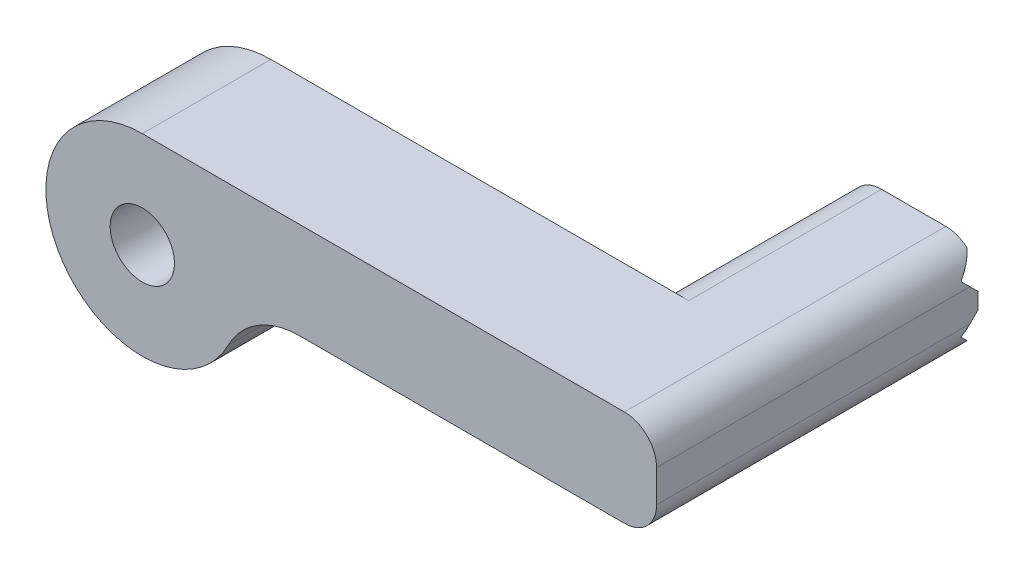
ISO-10303-21;
HEADER;
FILE_DESCRIPTION(('STEP AP214'),'2;1');
FILE_NAME('part.step','',(''),(''),'','','');
FILE_SCHEMA(('AUTOMOTIVE_DESIGN { 1 0 10303 214 1 1 1 1 }'));
ENDSEC;
DATA;
#1=APPLICATION_CONTEXT('core data for automotive mechanical design processes');
#2=APPLICATION_PROTOCOL_DEFINITION('international standard','automotive_design',2000,#1);
#3=PRODUCT_CONTEXT('',#1,'mechanical');
#4=PRODUCT('Part','Part','',(#3));
#5=PRODUCT_RELATED_PRODUCT_CATEGORY('part','',(#4));
#6=PRODUCT_DEFINITION_FORMATION('','',#4);
#7=PRODUCT_DEFINITION_CONTEXT('part definition',#1,'design');
#8=PRODUCT_DEFINITION('design','',#6,#7);
#9=PRODUCT_DEFINITION_SHAPE('','',#8);
#10=(LENGTH_UNIT() NAMED_UNIT(*) SI_UNIT(.MILLI.,.METRE.));
#11=(NAMED_UNIT(*) PLANE_ANGLE_UNIT() SI_UNIT($,.RADIAN.));
#12=(NAMED_UNIT(*) SI_UNIT($,.STERADIAN.) SOLID_ANGLE_UNIT());
#13=UNCERTAINTY_MEASURE_WITH_UNIT(LENGTH_MEASURE(1.E-05),#10,'distance_accuracy_value','');
#14=(GEOMETRIC_REPRESENTATION_CONTEXT(3) GLOBAL_UNCERTAINTY_ASSIGNED_CONTEXT((#13)) GLOBAL_UNIT_ASSIGNED_CONTEXT((#10,
#11,#12)) REPRESENTATION_CONTEXT('',''));
#15=CARTESIAN_POINT('',(0.,0.,0.));
#16=DIRECTION('',(0.,0.,1.));
#17=DIRECTION('',(1.,0.,0.));
#18=AXIS2_PLACEMENT_3D('',#15,#16,#17);
#19=CARTESIAN_POINT('',(0.,0.,-12.));
#20=DIRECTION('',(0.,0.,1.));
#21=DIRECTION('',(1.,0.,0.));
#22=AXIS2_PLACEMENT_3D('',#19,#20,#21);
#23=PLANE('',#22);
#24=CARTESIAN_POINT('',(-25.3162358800759,68.971177362986,-12.));
#25=DIRECTION('',(0.,0.,1.));
#26=DIRECTION('',(1.,0.,0.));
#27=AXIS2_PLACEMENT_3D('',#24,#25,#26);
#28=CIRCLE('',#27,2.);
#29=CARTESIAN_POINT('',(-25.3162358800759,70.971177362986,-12.));
#30=VERTEX_POINT('',#29);
#31=CARTESIAN_POINT('',(-23.9933602245436,70.4711773629859,-12.));
#32=VERTEX_POINT('',#31);
#33=EDGE_CURVE('E206',#30,#32,#28,.F.);
#34=ORIENTED_EDGE('',*,*,#33,.T.);
#35=DIRECTION('',(-1.,0.,0.));
#36=VECTOR('',#35,1.);
#37=CARTESIAN_POINT('',(-23.3162358800759,70.4711773629859,-12.));
#38=LINE('',#37,#36);
#39=CARTESIAN_POINT('',(-30.6391115356081,70.471177362986,-12.));
#40=VERTEX_POINT('',#39);
#41=EDGE_CURVE('E331',#32,#40,#38,.T.);
#42=ORIENTED_EDGE('',*,*,#41,.T.);
#43=CARTESIAN_POINT('',(-29.3162358800759,68.971177362986,-12.));
#44=DIRECTION('',(0.,0.,1.));
#45=DIRECTION('',(1.,0.,0.));
#46=AXIS2_PLACEMENT_3D('',#43,#44,#45);
#47=CIRCLE('',#46,2.);
#48=CARTESIAN_POINT('',(-29.3162358800759,70.971177362986,-12.));
#49=VERTEX_POINT('',#48);
#50=EDGE_CURVE('E214',#40,#49,#47,.F.);
#51=ORIENTED_EDGE('',*,*,#50,.T.);
#52=DIRECTION('',(-1.,0.,0.));
#53=VECTOR('',#52,1.);
#54=CARTESIAN_POINT('',(-23.3162358800759,70.971177362986,-12.));
#55=LINE('',#54,#53);
#56=EDGE_CURVE('E178',#30,#49,#55,.T.);
#57=ORIENTED_EDGE('',*,*,#56,.F.);
#58=EDGE_LOOP('',(#34,#42,#51,#57));
#59=FACE_BOUND('',#58,.T.);
#60=ADVANCED_FACE('F34',(#59),#23,.F.);
#61=DIRECTION('',(0.,-1.,0.));
#62=VECTOR('',#61,1.);
#63=CARTESIAN_POINT('',(-31.3162358800759,67.971177362986,-12.));
#64=LINE('',#63,#62);
#65=CARTESIAN_POINT('',(-31.3162358800759,68.471177362986,-12.));
#66=VERTEX_POINT('',#65);
#67=CARTESIAN_POINT('',(-31.3162358800759,67.471177362986,-12.));
#68=VERTEX_POINT('',#67);
#69=EDGE_CURVE('E185',#66,#68,#64,.T.);
#70=ORIENTED_EDGE('',*,*,#69,.F.);
#71=DIRECTION('',(-1.,0.,0.));
#72=VECTOR('',#71,1.);
#73=CARTESIAN_POINT('',(-23.3162358800759,68.471177362986,-12.));
#74=LINE('',#73,#72);
#75=CARTESIAN_POINT('',(-23.3162358800759,68.471177362986,-12.));
#76=VERTEX_POINT('',#75);
#77=EDGE_CURVE('E162',#76,#66,#74,.T.);
#78=ORIENTED_EDGE('',*,*,#77,.F.);
#79=DIRECTION('',(0.,1.,0.));
#80=VECTOR('',#79,1.);
#81=CARTESIAN_POINT('',(-23.3162358800759,64.971177362986,-12.));
#82=LINE('',#81,#80);
#83=CARTESIAN_POINT('',(-23.3162358800759,67.471177362986,-12.));
#84=VERTEX_POINT('',#83);
#85=EDGE_CURVE('E169',#84,#76,#82,.T.);
#86=ORIENTED_EDGE('',*,*,#85,.F.);
#87=DIRECTION('',(-1.,0.,0.));
#88=VECTOR('',#87,1.);
#89=CARTESIAN_POINT('',(-23.3162358800759,67.471177362986,-12.));
#90=LINE('',#89,#88);
#91=EDGE_CURVE('E151',#84,#68,#90,.T.);
#92=ORIENTED_EDGE('',*,*,#91,.T.);
#93=EDGE_LOOP('',(#70,#78,#86,#92));
#94=FACE_BOUND('',#93,.T.);
#95=ADVANCED_FACE('F177',(#94),#23,.F.);
#96=CARTESIAN_POINT('',(-23.3162358800759,70.971177362986,8.));
#97=DIRECTION('',(0.,-1.,0.));
#98=DIRECTION('',(1.,0.,0.));
#99=AXIS2_PLACEMENT_3D('',#96,#97,#98);
#100=PLANE('',#99);
#101=ORIENTED_EDGE('',*,*,#56,.T.);
#102=DIRECTION('',(0.,0.,1.));
#103=VECTOR('',#102,1.);
#104=CARTESIAN_POINT('',(-29.3162358800759,70.971177362986,0.));
#105=LINE('',#104,#103);
#106=CARTESIAN_POINT('',(-29.3162358800759,70.971177362986,0.));
#107=VERTEX_POINT('',#106);
#108=EDGE_CURVE('E199',#49,#107,#105,.T.);
#109=ORIENTED_EDGE('',*,*,#108,.T.);
#110=DIRECTION('',(-1.,0.,0.));
#111=VECTOR('',#110,1.);
#112=CARTESIAN_POINT('',(-23.3162358800759,70.971177362986,0.));
#113=LINE('',#112,#111);
#114=CARTESIAN_POINT('',(-55.3162358800759,70.9711773629859,0.));
#115=VERTEX_POINT('',#114);
#116=EDGE_CURVE('E182',#107,#115,#113,.T.);
#117=ORIENTED_EDGE('',*,*,#116,.T.);
#118=DIRECTION('',(0.,0.,-1.));
#119=VECTOR('',#118,1.);
#120=CARTESIAN_POINT('',(-55.3162358800759,70.9711773629859,8.));
#121=LINE('',#120,#119);
#122=CARTESIAN_POINT('',(-55.3162358800759,70.9711773629859,8.));
#123=VERTEX_POINT('',#122);
#124=EDGE_CURVE('E277',#123,#115,#121,.T.);
#125=ORIENTED_EDGE('',*,*,#124,.F.);
#126=DIRECTION('',(-1.,0.,0.));
#127=VECTOR('',#126,1.);
#128=CARTESIAN_POINT('',(-23.3162358800759,70.971177362986,8.));
#129=LINE('',#128,#127);
#130=CARTESIAN_POINT('',(-25.3162358800759,70.971177362986,8.));
#131=VERTEX_POINT('',#130);
#132=EDGE_CURVE('E323',#131,#123,#129,.T.);
#133=ORIENTED_EDGE('',*,*,#132,.F.);
#134=DIRECTION('',(0.,0.,-1.));
#135=VECTOR('',#134,1.);
#136=CARTESIAN_POINT('',(-25.3162358800759,70.971177362986,8.));
#137=LINE('',#136,#135);
#138=EDGE_CURVE('E282',#131,#30,#137,.T.);
#139=ORIENTED_EDGE('',*,*,#138,.T.);
#140=EDGE_LOOP('',(#101,#109,#117,#125,#133,#139));
#141=FACE_BOUND('',#140,.T.);
#142=ADVANCED_FACE('F300',(#141),#100,.F.);
#143=CARTESIAN_POINT('',(-55.3162358800759,64.971177362986,8.));
#144=DIRECTION('',(0.,0.,-1.));
#145=DIRECTION('',(-1.,0.,0.));
#146=AXIS2_PLACEMENT_3D('',#143,#144,#145);
#147=CYLINDRICAL_SURFACE('',#146,5.99999999999998);
#148=CARTESIAN_POINT('',(-55.3162358800759,64.971177362986,0.));
#149=DIRECTION('',(0.,0.,1.));
#150=DIRECTION('',(1.,0.,0.));
#151=AXIS2_PLACEMENT_3D('',#148,#149,#150);
#152=CIRCLE('',#151,5.99999999999998);
#153=CARTESIAN_POINT('',(-49.9718946230944,62.2439046357132,0.));
#154=VERTEX_POINT('',#153);
#155=EDGE_CURVE('E272',#115,#154,#152,.T.);
#156=ORIENTED_EDGE('',*,*,#155,.T.);
#157=DIRECTION('',(0.,0.,-1.));
#158=VECTOR('',#157,1.);
#159=CARTESIAN_POINT('',(-49.9718946230944,62.2439046357132,8.));
#160=LINE('',#159,#158);
#161=CARTESIAN_POINT('',(-49.9718946230944,62.2439046357132,8.));
#162=VERTEX_POINT('',#161);
#163=EDGE_CURVE('E264',#162,#154,#160,.T.);
#164=ORIENTED_EDGE('',*,*,#163,.F.);
#165=CARTESIAN_POINT('',(-55.3162358800759,64.971177362986,8.));
#166=DIRECTION('',(0.,0.,1.));
#167=DIRECTION('',(1.,0.,0.));
#168=AXIS2_PLACEMENT_3D('',#165,#166,#167);
#169=CIRCLE('',#168,5.99999999999998);
#170=EDGE_CURVE('E266',#123,#162,#169,.T.);
#171=ORIENTED_EDGE('',*,*,#170,.F.);
#172=ORIENTED_EDGE('',*,*,#124,.T.);
#173=EDGE_LOOP('',(#156,#164,#171,#172));
#174=FACE_BOUND('',#173,.T.);
#175=ADVANCED_FACE('F322',(#174),#147,.T.);
#176=CARTESIAN_POINT('',(-45.5182769089432,59.971177362986,8.));
#177=DIRECTION('',(0.,0.,-1.));
#178=DIRECTION('',(-1.,0.,0.));
#179=AXIS2_PLACEMENT_3D('',#176,#177,#178);
#180=CYLINDRICAL_SURFACE('',#179,5.);
#181=CARTESIAN_POINT('',(-45.5182769089432,59.971177362986,0.));
#182=DIRECTION('',(0.,0.,-1.));
#183=DIRECTION('',(-1.,0.,0.));
#184=AXIS2_PLACEMENT_3D('',#181,#182,#183);
#185=CIRCLE('',#184,5.);
#186=CARTESIAN_POINT('',(-45.5182769089432,64.971177362986,0.));
#187=VERTEX_POINT('',#186);
#188=EDGE_CURVE('E281',#154,#187,#185,.T.);
#189=ORIENTED_EDGE('',*,*,#188,.T.);
#190=DIRECTION('',(0.,0.,-1.));
#191=VECTOR('',#190,1.);
#192=CARTESIAN_POINT('',(-45.5182769089432,64.971177362986,8.));
#193=LINE('',#192,#191);
#194=CARTESIAN_POINT('',(-45.5182769089432,64.971177362986,8.));
#195=VERTEX_POINT('',#194);
#196=EDGE_CURVE('E262',#195,#187,#193,.T.);
#197=ORIENTED_EDGE('',*,*,#196,.F.);
#198=CARTESIAN_POINT('',(-45.5182769089432,59.971177362986,8.));
#199=DIRECTION('',(0.,0.,-1.));
#200=DIRECTION('',(-1.,0.,0.));
#201=AXIS2_PLACEMENT_3D('',#198,#199,#200);
#202=CIRCLE('',#201,5.);
#203=EDGE_CURVE('E260',#162,#195,#202,.T.);
#204=ORIENTED_EDGE('',*,*,#203,.F.);
#205=ORIENTED_EDGE('',*,*,#163,.T.);
#206=EDGE_LOOP('',(#189,#197,#204,#205));
#207=FACE_BOUND('',#206,.T.);
#208=ADVANCED_FACE('F321',(#207),#180,.F.);
#209=CARTESIAN_POINT('',(-45.5182769089432,64.971177362986,8.));
#210=DIRECTION('',(0.,1.,0.));
#211=DIRECTION('',(0.,0.,1.));
#212=AXIS2_PLACEMENT_3D('',#209,#210,#211);
#213=PLANE('',#212);
#214=DIRECTION('',(1.,0.,0.));
#215=VECTOR('',#214,1.);
#216=CARTESIAN_POINT('',(-45.5182769089432,64.971177362986,0.));
#217=LINE('',#216,#215);
#218=CARTESIAN_POINT('',(-29.3162358800759,64.971177362986,0.));
#219=VERTEX_POINT('',#218);
#220=EDGE_CURVE('E279',#187,#219,#217,.T.);
#221=ORIENTED_EDGE('',*,*,#220,.T.);
#222=DIRECTION('',(0.,0.,1.));
#223=VECTOR('',#222,1.);
#224=CARTESIAN_POINT('',(-29.3162358800759,64.971177362986,-12.));
#225=LINE('',#224,#223);
#226=CARTESIAN_POINT('',(-29.3162358800759,64.971177362986,-12.));
#227=VERTEX_POINT('',#226);
#228=EDGE_CURVE('E218',#219,#227,#225,.F.);
#229=ORIENTED_EDGE('',*,*,#228,.T.);
#230=DIRECTION('',(1.,0.,0.));
#231=VECTOR('',#230,1.);
#232=CARTESIAN_POINT('',(-31.3162358800759,64.971177362986,-12.));
#233=LINE('',#232,#231);
#234=CARTESIAN_POINT('',(-25.3162358800759,64.971177362986,-12.));
#235=VERTEX_POINT('',#234);
#236=EDGE_CURVE('E179',#227,#235,#233,.T.);
#237=ORIENTED_EDGE('',*,*,#236,.T.);
#238=DIRECTION('',(0.,0.,-1.));
#239=VECTOR('',#238,1.);
#240=CARTESIAN_POINT('',(-25.3162358800759,64.971177362986,8.));
#241=LINE('',#240,#239);
#242=CARTESIAN_POINT('',(-25.3162358800759,64.971177362986,8.));
#243=VERTEX_POINT('',#242);
#244=EDGE_CURVE('E216',#235,#243,#241,.F.);
#245=ORIENTED_EDGE('',*,*,#244,.T.);
#246=DIRECTION('',(1.,0.,0.));
#247=VECTOR('',#246,1.);
#248=CARTESIAN_POINT('',(-45.5182769089432,64.971177362986,8.));
#249=LINE('',#248,#247);
#250=EDGE_CURVE('E255',#195,#243,#249,.T.);
#251=ORIENTED_EDGE('',*,*,#250,.F.);
#252=ORIENTED_EDGE('',*,*,#196,.T.);
#253=EDGE_LOOP('',(#221,#229,#237,#245,#251,#252));
#254=FACE_BOUND('',#253,.T.);
#255=ADVANCED_FACE('F253',(#254),#213,.F.);
#256=CARTESIAN_POINT('',(-23.3162358800759,64.971177362986,8.));
#257=DIRECTION('',(-1.,0.,0.));
#258=DIRECTION('',(0.,0.,1.));
#259=AXIS2_PLACEMENT_3D('',#256,#257,#258);
#260=PLANE('',#259);
#261=ORIENTED_EDGE('',*,*,#85,.T.);
#262=DIRECTION('',(0.,0.70710678118654,0.707106781186555));
#263=VECTOR('',#262,1.);
#264=CARTESIAN_POINT('',(-23.3162358800759,69.4711773629859,-11.));
#265=LINE('',#264,#263);
#266=CARTESIAN_POINT('',(-23.3162358800759,68.9711773629859,-11.5));
#267=VERTEX_POINT('',#266);
#268=EDGE_CURVE('E173',#76,#267,#265,.T.);
#269=ORIENTED_EDGE('',*,*,#268,.T.);
#270=DIRECTION('',(0.,0.,-1.));
#271=VECTOR('',#270,1.);
#272=CARTESIAN_POINT('',(-23.3162358800759,68.971177362986,8.));
#273=LINE('',#272,#271);
#274=CARTESIAN_POINT('',(-23.3162358800759,68.971177362986,8.));
#275=VERTEX_POINT('',#274);
#276=EDGE_CURVE('E220',#267,#275,#273,.F.);
#277=ORIENTED_EDGE('',*,*,#276,.T.);
#278=DIRECTION('',(0.,1.,0.));
#279=VECTOR('',#278,1.);
#280=CARTESIAN_POINT('',(-23.3162358800759,68.971177362986,8.));
#281=LINE('',#280,#279);
#282=CARTESIAN_POINT('',(-23.3162358800759,66.971177362986,8.));
#283=VERTEX_POINT('',#282);
#284=EDGE_CURVE('E191',#283,#275,#281,.T.);
#285=ORIENTED_EDGE('',*,*,#284,.F.);
#286=DIRECTION('',(0.,0.,-1.));
#287=VECTOR('',#286,1.);
#288=CARTESIAN_POINT('',(-23.3162358800759,66.971177362986,8.));
#289=LINE('',#288,#287);
#290=CARTESIAN_POINT('',(-23.3162358800759,66.9711773629859,-11.5));
#291=VERTEX_POINT('',#290);
#292=EDGE_CURVE('E172',#283,#291,#289,.T.);
#293=ORIENTED_EDGE('',*,*,#292,.T.);
#294=DIRECTION('',(0.,0.707106781186543,-0.707106781186552));
#295=VECTOR('',#294,1.);
#296=CARTESIAN_POINT('',(-23.3162358800759,66.471177362986,-11.));
#297=LINE('',#296,#295);
#298=EDGE_CURVE('E154',#291,#84,#297,.T.);
#299=ORIENTED_EDGE('',*,*,#298,.T.);
#300=EDGE_LOOP('',(#261,#269,#277,#285,#293,#299));
#301=FACE_BOUND('',#300,.T.);
#302=ADVANCED_FACE('F167',(#301),#260,.F.);
#303=CARTESIAN_POINT('',(-55.3162358800759,64.971177362986,8.));
#304=DIRECTION('',(0.,0.,1.));
#305=DIRECTION('',(1.,0.,0.));
#306=AXIS2_PLACEMENT_3D('',#303,#304,#305);
#307=PLANE('',#306);
#308=CARTESIAN_POINT('',(-55.3162358800759,64.971177362986,8.));
#309=DIRECTION('',(0.,0.,-1.));
#310=DIRECTION('',(-1.,0.,0.));
#311=AXIS2_PLACEMENT_3D('',#308,#309,#310);
#312=CIRCLE('',#311,2.);
#313=CARTESIAN_POINT('',(-57.3162358800759,64.971177362986,8.));
#314=VERTEX_POINT('',#313);
#315=EDGE_CURVE('E198',#314,#314,#312,.T.);
#316=ORIENTED_EDGE('',*,*,#315,.T.);
#317=EDGE_LOOP('',(#316));
#318=FACE_BOUND('',#317,.T.);
#319=ORIENTED_EDGE('',*,*,#250,.T.);
#320=CARTESIAN_POINT('',(-25.3162358800759,66.971177362986,8.));
#321=DIRECTION('',(0.,0.,1.));
#322=DIRECTION('',(1.,0.,0.));
#323=AXIS2_PLACEMENT_3D('',#320,#321,#322);
#324=CIRCLE('',#323,2.);
#325=EDGE_CURVE('E225',#243,#283,#324,.T.);
#326=ORIENTED_EDGE('',*,*,#325,.T.);
#327=ORIENTED_EDGE('',*,*,#284,.T.);
#328=CARTESIAN_POINT('',(-25.3162358800759,68.971177362986,8.));
#329=DIRECTION('',(0.,0.,1.));
#330=DIRECTION('',(1.,0.,0.));
#331=AXIS2_PLACEMENT_3D('',#328,#329,#330);
#332=CIRCLE('',#331,2.);
#333=EDGE_CURVE('E223',#275,#131,#332,.T.);
#334=ORIENTED_EDGE('',*,*,#333,.T.);
#335=ORIENTED_EDGE('',*,*,#132,.T.);
#336=ORIENTED_EDGE('',*,*,#170,.T.);
#337=ORIENTED_EDGE('',*,*,#203,.T.);
#338=EDGE_LOOP('',(#319,#326,#327,#334,#335,#336,#337));
#339=FACE_BOUND('',#338,.T.);
#340=ADVANCED_FACE('F257',(#318,#339),#307,.T.);
#341=CARTESIAN_POINT('',(-55.3162358800759,64.971177362986,0.));
#342=DIRECTION('',(0.,0.,1.));
#343=DIRECTION('',(1.,0.,0.));
#344=AXIS2_PLACEMENT_3D('',#341,#342,#343);
#345=PLANE('',#344);
#346=CARTESIAN_POINT('',(-55.3162358800759,64.971177362986,0.));
#347=DIRECTION('',(0.,0.,-1.));
#348=DIRECTION('',(-1.,0.,0.));
#349=AXIS2_PLACEMENT_3D('',#346,#347,#348);
#350=CIRCLE('',#349,2.);
#351=CARTESIAN_POINT('',(-57.3162358800759,64.971177362986,0.));
#352=VERTEX_POINT('',#351);
#353=EDGE_CURVE('E348',#352,#352,#350,.T.);
#354=ORIENTED_EDGE('',*,*,#353,.F.);
#355=EDGE_LOOP('',(#354));
#356=FACE_BOUND('',#355,.T.);
#357=ORIENTED_EDGE('',*,*,#116,.F.);
#358=CARTESIAN_POINT('',(-29.3162358800759,68.971177362986,0.));
#359=DIRECTION('',(0.,0.,1.));
#360=DIRECTION('',(1.,0.,0.));
#361=AXIS2_PLACEMENT_3D('',#358,#359,#360);
#362=CIRCLE('',#361,2.);
#363=CARTESIAN_POINT('',(-31.3162358800759,68.971177362986,0.));
#364=VERTEX_POINT('',#363);
#365=EDGE_CURVE('E227',#107,#364,#362,.T.);
#366=ORIENTED_EDGE('',*,*,#365,.T.);
#367=DIRECTION('',(0.,-1.,0.));
#368=VECTOR('',#367,1.);
#369=CARTESIAN_POINT('',(-31.3162358800759,70.971177362986,0.));
#370=LINE('',#369,#368);
#371=CARTESIAN_POINT('',(-31.3162358800759,66.971177362986,0.));
#372=VERTEX_POINT('',#371);
#373=EDGE_CURVE('E194',#364,#372,#370,.T.);
#374=ORIENTED_EDGE('',*,*,#373,.T.);
#375=CARTESIAN_POINT('',(-29.3162358800759,66.971177362986,0.));
#376=DIRECTION('',(0.,0.,1.));
#377=DIRECTION('',(1.,0.,0.));
#378=AXIS2_PLACEMENT_3D('',#375,#376,#377);
#379=CIRCLE('',#378,2.);
#380=EDGE_CURVE('E229',#372,#219,#379,.T.);
#381=ORIENTED_EDGE('',*,*,#380,.T.);
#382=ORIENTED_EDGE('',*,*,#220,.F.);
#383=ORIENTED_EDGE('',*,*,#188,.F.);
#384=ORIENTED_EDGE('',*,*,#155,.F.);
#385=EDGE_LOOP('',(#357,#366,#374,#381,#382,#383,#384));
#386=FACE_BOUND('',#385,.T.);
#387=ADVANCED_FACE('F310',(#356,#386),#345,.F.);
#388=CARTESIAN_POINT('',(-31.3162358800759,70.971177362986,-12.));
#389=DIRECTION('',(-1.,0.,0.));
#390=DIRECTION('',(0.,-1.,0.));
#391=AXIS2_PLACEMENT_3D('',#388,#389,#390);
#392=PLANE('',#391);
#393=DIRECTION('',(0.,0.70710678118654,0.707106781186555));
#394=VECTOR('',#393,1.);
#395=CARTESIAN_POINT('',(-31.3162358800759,69.4711773629859,-11.));
#396=LINE('',#395,#394);
#397=CARTESIAN_POINT('',(-31.3162358800759,68.971177362986,-11.5));
#398=VERTEX_POINT('',#397);
#399=EDGE_CURVE('E174',#66,#398,#396,.T.);
#400=ORIENTED_EDGE('',*,*,#399,.F.);
#401=ORIENTED_EDGE('',*,*,#69,.T.);
#402=DIRECTION('',(0.,0.707106781186543,-0.707106781186552));
#403=VECTOR('',#402,1.);
#404=CARTESIAN_POINT('',(-31.3162358800759,66.471177362986,-11.));
#405=LINE('',#404,#403);
#406=CARTESIAN_POINT('',(-31.3162358800759,66.971177362986,-11.5));
#407=VERTEX_POINT('',#406);
#408=EDGE_CURVE('E157',#407,#68,#405,.T.);
#409=ORIENTED_EDGE('',*,*,#408,.F.);
#410=DIRECTION('',(0.,0.,1.));
#411=VECTOR('',#410,1.);
#412=CARTESIAN_POINT('',(-31.3162358800759,66.971177362986,0.));
#413=LINE('',#412,#411);
#414=EDGE_CURVE('E201',#407,#372,#413,.T.);
#415=ORIENTED_EDGE('',*,*,#414,.T.);
#416=ORIENTED_EDGE('',*,*,#373,.F.);
#417=DIRECTION('',(0.,0.,1.));
#418=VECTOR('',#417,1.);
#419=CARTESIAN_POINT('',(-31.3162358800759,68.971177362986,-12.));
#420=LINE('',#419,#418);
#421=EDGE_CURVE('E203',#364,#398,#420,.F.);
#422=ORIENTED_EDGE('',*,*,#421,.T.);
#423=EDGE_LOOP('',(#400,#401,#409,#415,#416,#422));
#424=FACE_BOUND('',#423,.T.);
#425=ADVANCED_FACE('F313',(#424),#392,.T.);
#426=CARTESIAN_POINT('',(-29.3162358800759,66.971177362986,-12.));
#427=DIRECTION('',(0.,0.,1.));
#428=DIRECTION('',(1.,0.,0.));
#429=AXIS2_PLACEMENT_3D('',#426,#427,#428);
#430=CIRCLE('',#429,2.);
#431=CARTESIAN_POINT('',(-30.6391115356082,65.471177362986,-12.));
#432=VERTEX_POINT('',#431);
#433=EDGE_CURVE('E211',#227,#432,#430,.F.);
#434=ORIENTED_EDGE('',*,*,#433,.T.);
#435=DIRECTION('',(-1.,0.,0.));
#436=VECTOR('',#435,1.);
#437=CARTESIAN_POINT('',(-23.3162358800759,65.471177362986,-12.));
#438=LINE('',#437,#436);
#439=CARTESIAN_POINT('',(-23.9933602245436,65.471177362986,-12.));
#440=VERTEX_POINT('',#439);
#441=EDGE_CURVE('E238',#440,#432,#438,.T.);
#442=ORIENTED_EDGE('',*,*,#441,.F.);
#443=CARTESIAN_POINT('',(-25.3162358800759,66.971177362986,-12.));
#444=DIRECTION('',(0.,0.,1.));
#445=DIRECTION('',(1.,0.,0.));
#446=AXIS2_PLACEMENT_3D('',#443,#444,#445);
#447=CIRCLE('',#446,2.);
#448=EDGE_CURVE('E209',#440,#235,#447,.F.);
#449=ORIENTED_EDGE('',*,*,#448,.T.);
#450=ORIENTED_EDGE('',*,*,#236,.F.);
#451=EDGE_LOOP('',(#434,#442,#449,#450));
#452=FACE_BOUND('',#451,.T.);
#453=ADVANCED_FACE('F243',(#452),#23,.F.);
#454=CARTESIAN_POINT('',(-55.3162358800759,64.971177362986,8.));
#455=DIRECTION('',(0.,0.,-1.));
#456=DIRECTION('',(-1.,0.,0.));
#457=AXIS2_PLACEMENT_3D('',#454,#455,#456);
#458=CYLINDRICAL_SURFACE('',#457,2.);
#459=ORIENTED_EDGE('',*,*,#315,.F.);
#460=EDGE_LOOP('',(#459));
#461=FACE_BOUND('',#460,.T.);
#462=ORIENTED_EDGE('',*,*,#353,.T.);
#463=EDGE_LOOP('',(#462));
#464=FACE_BOUND('',#463,.T.);
#465=ADVANCED_FACE('F371',(#461,#464),#458,.F.);
#466=CARTESIAN_POINT('',(-29.3162358800759,68.971177362986,8.));
#467=DIRECTION('',(0.,0.,-1.));
#468=DIRECTION('',(-1.,0.,0.));
#469=AXIS2_PLACEMENT_3D('',#466,#467,#468);
#470=CYLINDRICAL_SURFACE('',#469,2.);
#471=CARTESIAN_POINT('',(-29.3162358800759,68.971177362986,-10.5));
#472=DIRECTION('',(0.,0.70710678118654,0.707106781186555));
#473=DIRECTION('',(0.,0.707106781186555,-0.70710678118654));
#474=AXIS2_PLACEMENT_3D('',#471,#472,#473);
#475=ELLIPSE('',#474,2.82842712474616,2.);
#476=CARTESIAN_POINT('',(-31.2527275531796,69.4711773629859,-11.));
#477=VERTEX_POINT('',#476);
#478=EDGE_CURVE('E335',#477,#40,#475,.F.);
#479=ORIENTED_EDGE('',*,*,#478,.F.);
#480=CARTESIAN_POINT('',(-29.3162358800759,68.971177362986,-11.5));
#481=DIRECTION('',(0.,-0.707106781186555,0.70710678118654));
#482=DIRECTION('',(0.,-0.70710678118654,-0.707106781186555));
#483=AXIS2_PLACEMENT_3D('',#480,#481,#482);
#484=ELLIPSE('',#483,2.82842712474622,2.);
#485=EDGE_CURVE('E333',#398,#477,#484,.F.);
#486=ORIENTED_EDGE('',*,*,#485,.F.);
#487=ORIENTED_EDGE('',*,*,#421,.F.);
#488=ORIENTED_EDGE('',*,*,#365,.F.);
#489=ORIENTED_EDGE('',*,*,#108,.F.);
#490=ORIENTED_EDGE('',*,*,#50,.F.);
#491=EDGE_LOOP('',(#479,#486,#487,#488,#489,#490));
#492=FACE_BOUND('',#491,.T.);
#493=ADVANCED_FACE('F305',(#492),#470,.T.);
#494=CARTESIAN_POINT('',(-29.3162358800759,66.971177362986,-12.));
#495=DIRECTION('',(0.,0.,-1.));
#496=DIRECTION('',(-1.,0.,0.));
#497=AXIS2_PLACEMENT_3D('',#494,#495,#496);
#498=CYLINDRICAL_SURFACE('',#497,2.);
#499=CARTESIAN_POINT('',(-29.3162358800759,66.971177362986,-11.5));
#500=DIRECTION('',(0.,0.707106781186552,0.707106781186543));
#501=DIRECTION('',(0.,0.707106781186543,-0.707106781186552));
#502=AXIS2_PLACEMENT_3D('',#499,#500,#501);
#503=ELLIPSE('',#502,2.82842712474621,2.);
#504=CARTESIAN_POINT('',(-31.2527275531796,66.471177362986,-11.));
#505=VERTEX_POINT('',#504);
#506=EDGE_CURVE('E346',#505,#407,#503,.F.);
#507=ORIENTED_EDGE('',*,*,#506,.F.);
#508=CARTESIAN_POINT('',(-29.3162358800759,66.971177362986,-10.5));
#509=DIRECTION('',(0.,-0.707106781186547,0.707106781186548));
#510=DIRECTION('',(0.,-0.707106781186548,-0.707106781186547));
#511=AXIS2_PLACEMENT_3D('',#508,#509,#510);
#512=ELLIPSE('',#511,2.82842712474619,2.);
#513=EDGE_CURVE('E344',#432,#505,#512,.F.);
#514=ORIENTED_EDGE('',*,*,#513,.F.);
#515=ORIENTED_EDGE('',*,*,#433,.F.);
#516=ORIENTED_EDGE('',*,*,#228,.F.);
#517=ORIENTED_EDGE('',*,*,#380,.F.);
#518=ORIENTED_EDGE('',*,*,#414,.F.);
#519=EDGE_LOOP('',(#507,#514,#515,#516,#517,#518));
#520=FACE_BOUND('',#519,.T.);
#521=ADVANCED_FACE('F319',(#520),#498,.T.);
#522=CARTESIAN_POINT('',(-25.3162358800759,66.971177362986,8.));
#523=DIRECTION('',(0.,0.,-1.));
#524=DIRECTION('',(-1.,0.,0.));
#525=AXIS2_PLACEMENT_3D('',#522,#523,#524);
#526=CYLINDRICAL_SURFACE('',#525,2.);
#527=CARTESIAN_POINT('',(-25.3162358800759,66.971177362986,-11.5));
#528=DIRECTION('',(0.,0.707106781186552,0.707106781186543));
#529=DIRECTION('',(0.,0.707106781186543,-0.707106781186552));
#530=AXIS2_PLACEMENT_3D('',#527,#528,#529);
#531=ELLIPSE('',#530,2.82842712474621,2.);
#532=CARTESIAN_POINT('',(-23.3797442069722,66.471177362986,-11.));
#533=VERTEX_POINT('',#532);
#534=EDGE_CURVE('E11',#291,#533,#531,.F.);
#535=ORIENTED_EDGE('',*,*,#534,.F.);
#536=ORIENTED_EDGE('',*,*,#292,.F.);
#537=ORIENTED_EDGE('',*,*,#325,.F.);
#538=ORIENTED_EDGE('',*,*,#244,.F.);
#539=ORIENTED_EDGE('',*,*,#448,.F.);
#540=CARTESIAN_POINT('',(-25.3162358800759,66.971177362986,-10.5));
#541=DIRECTION('',(0.,-0.707106781186547,0.707106781186548));
#542=DIRECTION('',(0.,-0.707106781186548,-0.707106781186547));
#543=AXIS2_PLACEMENT_3D('',#540,#541,#542);
#544=ELLIPSE('',#543,2.82842712474619,2.);
#545=EDGE_CURVE('E42',#533,#440,#544,.F.);
#546=ORIENTED_EDGE('',*,*,#545,.F.);
#547=EDGE_LOOP('',(#535,#536,#537,#538,#539,#546));
#548=FACE_BOUND('',#547,.T.);
#549=ADVANCED_FACE('F248',(#548),#526,.T.);
#550=CARTESIAN_POINT('',(-25.3162358800759,68.971177362986,8.));
#551=DIRECTION('',(0.,0.,-1.));
#552=DIRECTION('',(-1.,0.,0.));
#553=AXIS2_PLACEMENT_3D('',#550,#551,#552);
#554=CYLINDRICAL_SURFACE('',#553,2.);
#555=CARTESIAN_POINT('',(-25.3162358800759,68.971177362986,-10.5));
#556=DIRECTION('',(0.,0.70710678118654,0.707106781186555));
#557=DIRECTION('',(0.,0.707106781186555,-0.70710678118654));
#558=AXIS2_PLACEMENT_3D('',#555,#556,#557);
#559=ELLIPSE('',#558,2.82842712474616,2.);
#560=CARTESIAN_POINT('',(-23.3797442069722,69.4711773629859,-11.));
#561=VERTEX_POINT('',#560);
#562=EDGE_CURVE('E234',#32,#561,#559,.F.);
#563=ORIENTED_EDGE('',*,*,#562,.F.);
#564=ORIENTED_EDGE('',*,*,#33,.F.);
#565=ORIENTED_EDGE('',*,*,#138,.F.);
#566=ORIENTED_EDGE('',*,*,#333,.F.);
#567=ORIENTED_EDGE('',*,*,#276,.F.);
#568=CARTESIAN_POINT('',(-25.3162358800759,68.971177362986,-11.5));
#569=DIRECTION('',(0.,-0.707106781186555,0.70710678118654));
#570=DIRECTION('',(0.,-0.70710678118654,-0.707106781186555));
#571=AXIS2_PLACEMENT_3D('',#568,#569,#570);
#572=ELLIPSE('',#571,2.82842712474622,2.);
#573=EDGE_CURVE('E232',#561,#267,#572,.F.);
#574=ORIENTED_EDGE('',*,*,#573,.F.);
#575=EDGE_LOOP('',(#563,#564,#565,#566,#567,#574));
#576=FACE_BOUND('',#575,.T.);
#577=ADVANCED_FACE('F36',(#576),#554,.T.);
#578=CARTESIAN_POINT('',(-23.3162358800759,69.4711773629859,-11.));
#579=DIRECTION('',(0.,-0.707106781186555,0.70710678118654));
#580=DIRECTION('',(0.,-0.70710678118654,-0.707106781186555));
#581=AXIS2_PLACEMENT_3D('',#578,#579,#580);
#582=PLANE('',#581);
#583=ORIENTED_EDGE('',*,*,#485,.T.);
#584=DIRECTION('',(-1.,0.,0.));
#585=VECTOR('',#584,1.);
#586=CARTESIAN_POINT('',(-23.3162358800759,69.4711773629859,-11.));
#587=LINE('',#586,#585);
#588=EDGE_CURVE('E56',#561,#477,#587,.T.);
#589=ORIENTED_EDGE('',*,*,#588,.F.);
#590=ORIENTED_EDGE('',*,*,#573,.T.);
#591=ORIENTED_EDGE('',*,*,#268,.F.);
#592=ORIENTED_EDGE('',*,*,#77,.T.);
#593=ORIENTED_EDGE('',*,*,#399,.T.);
#594=EDGE_LOOP('',(#583,#589,#590,#591,#592,#593));
#595=FACE_BOUND('',#594,.T.);
#596=ADVANCED_FACE('F353',(#595),#582,.F.);
#597=CARTESIAN_POINT('',(-23.3162358800759,70.4711773629859,-12.));
#598=DIRECTION('',(0.,0.70710678118654,0.707106781186555));
#599=DIRECTION('',(0.,-0.707106781186555,0.70710678118654));
#600=AXIS2_PLACEMENT_3D('',#597,#598,#599);
#601=PLANE('',#600);
#602=ORIENTED_EDGE('',*,*,#478,.T.);
#603=ORIENTED_EDGE('',*,*,#41,.F.);
#604=ORIENTED_EDGE('',*,*,#562,.T.);
#605=ORIENTED_EDGE('',*,*,#588,.T.);
#606=EDGE_LOOP('',(#602,#603,#604,#605));
#607=FACE_BOUND('',#606,.T.);
#608=ADVANCED_FACE('F355',(#607),#601,.F.);
#609=CARTESIAN_POINT('',(-23.3162358800759,66.471177362986,-11.));
#610=DIRECTION('',(0.,0.707106781186552,0.707106781186543));
#611=DIRECTION('',(0.,-0.707106781186543,0.707106781186552));
#612=AXIS2_PLACEMENT_3D('',#609,#610,#611);
#613=PLANE('',#612);
#614=ORIENTED_EDGE('',*,*,#506,.T.);
#615=ORIENTED_EDGE('',*,*,#408,.T.);
#616=ORIENTED_EDGE('',*,*,#91,.F.);
#617=ORIENTED_EDGE('',*,*,#298,.F.);
#618=ORIENTED_EDGE('',*,*,#534,.T.);
#619=DIRECTION('',(-1.,0.,0.));
#620=VECTOR('',#619,1.);
#621=CARTESIAN_POINT('',(-23.3162358800759,66.471177362986,-11.));
#622=LINE('',#621,#620);
#623=EDGE_CURVE('E49',#533,#505,#622,.T.);
#624=ORIENTED_EDGE('',*,*,#623,.T.);
#625=EDGE_LOOP('',(#614,#615,#616,#617,#618,#624));
#626=FACE_BOUND('',#625,.T.);
#627=ADVANCED_FACE('F153',(#626),#613,.F.);
#628=CARTESIAN_POINT('',(-23.3162358800759,65.471177362986,-12.));
#629=DIRECTION('',(0.,-0.707106781186547,0.707106781186548));
#630=DIRECTION('',(0.,-0.707106781186548,-0.707106781186547));
#631=AXIS2_PLACEMENT_3D('',#628,#629,#630);
#632=PLANE('',#631);
#633=ORIENTED_EDGE('',*,*,#513,.T.);
#634=ORIENTED_EDGE('',*,*,#623,.F.);
#635=ORIENTED_EDGE('',*,*,#545,.T.);
#636=ORIENTED_EDGE('',*,*,#441,.T.);
#637=EDGE_LOOP('',(#633,#634,#635,#636));
#638=FACE_BOUND('',#637,.T.);
#639=ADVANCED_FACE('F237',(#638),#632,.F.);
#640=CLOSED_SHELL('',(#60,#95,#142,#175,#208,#255,#302,#340,#387,#425,#453,#465,#493,#521,#549,
#577,#596,#608,#627,#639));
#641=MANIFOLD_SOLID_BREP('B2',#640);
#642=ADVANCED_BREP_SHAPE_REPRESENTATION('',(#18,#641),#14);
#643=SHAPE_DEFINITION_REPRESENTATION(#9,#642);
ENDSEC;
END-ISO-10303-21;
